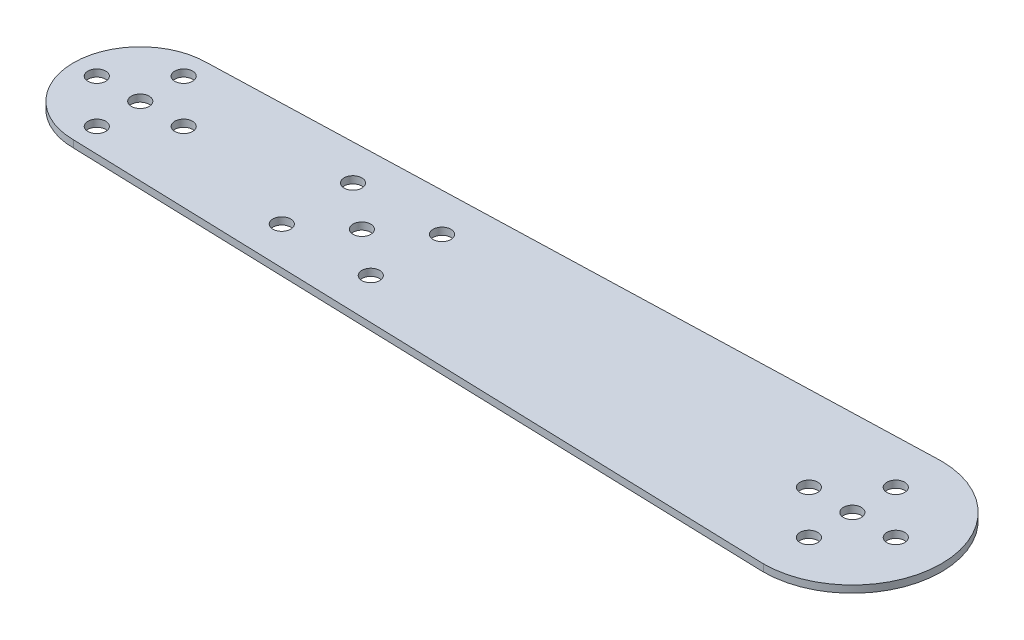
ISO-10303-21;
HEADER;
FILE_DESCRIPTION(('STEP AP214'),'2;1');
FILE_NAME('part.step','',(''),(''),'','','');
FILE_SCHEMA(('AUTOMOTIVE_DESIGN { 1 0 10303 214 1 1 1 1 }'));
ENDSEC;
DATA;
#1=APPLICATION_CONTEXT('core data for automotive mechanical design processes');
#2=APPLICATION_PROTOCOL_DEFINITION('international standard','automotive_design',2000,#1);
#3=PRODUCT_CONTEXT('',#1,'mechanical');
#4=PRODUCT('Part','Part','',(#3));
#5=PRODUCT_RELATED_PRODUCT_CATEGORY('part','',(#4));
#6=PRODUCT_DEFINITION_FORMATION('','',#4);
#7=PRODUCT_DEFINITION_CONTEXT('part definition',#1,'design');
#8=PRODUCT_DEFINITION('design','',#6,#7);
#9=PRODUCT_DEFINITION_SHAPE('','',#8);
#10=(LENGTH_UNIT() NAMED_UNIT(*) SI_UNIT(.MILLI.,.METRE.));
#11=(NAMED_UNIT(*) PLANE_ANGLE_UNIT() SI_UNIT($,.RADIAN.));
#12=(NAMED_UNIT(*) SI_UNIT($,.STERADIAN.) SOLID_ANGLE_UNIT());
#13=UNCERTAINTY_MEASURE_WITH_UNIT(LENGTH_MEASURE(1.E-05),#10,'distance_accuracy_value','');
#14=(GEOMETRIC_REPRESENTATION_CONTEXT(3) GLOBAL_UNCERTAINTY_ASSIGNED_CONTEXT((#13)) GLOBAL_UNIT_ASSIGNED_CONTEXT((#10,
#11,#12)) REPRESENTATION_CONTEXT('',''));
#15=CARTESIAN_POINT('',(0.,0.,0.));
#16=DIRECTION('',(0.,0.,1.));
#17=DIRECTION('',(1.,0.,0.));
#18=AXIS2_PLACEMENT_3D('',#15,#16,#17);
#19=CARTESIAN_POINT('',(100.,2.,0.));
#20=DIRECTION('',(0.,-1.,0.));
#21=DIRECTION('',(0.,0.,-1.));
#22=AXIS2_PLACEMENT_3D('',#19,#20,#21);
#23=CYLINDRICAL_SURFACE('',#22,25.);
#24=CARTESIAN_POINT('',(100.,0.,0.));
#25=DIRECTION('',(0.,1.,0.));
#26=DIRECTION('',(0.,0.,1.));
#27=AXIS2_PLACEMENT_3D('',#24,#25,#26);
#28=CIRCLE('',#27,25.);
#29=CARTESIAN_POINT('',(100.,0.,25.));
#30=VERTEX_POINT('',#29);
#31=CARTESIAN_POINT('',(100.,0.,-25.));
#32=VERTEX_POINT('',#31);
#33=EDGE_CURVE('E98',#30,#32,#28,.T.);
#34=ORIENTED_EDGE('',*,*,#33,.T.);
#35=DIRECTION('',(0.,-1.,0.));
#36=VECTOR('',#35,1.);
#37=CARTESIAN_POINT('',(100.,2.,-25.));
#38=LINE('',#37,#36);
#39=CARTESIAN_POINT('',(100.,2.,-25.));
#40=VERTEX_POINT('',#39);
#41=EDGE_CURVE('E11',#40,#32,#38,.T.);
#42=ORIENTED_EDGE('',*,*,#41,.F.);
#43=CARTESIAN_POINT('',(100.,2.,0.));
#44=DIRECTION('',(0.,1.,0.));
#45=DIRECTION('',(0.,0.,1.));
#46=AXIS2_PLACEMENT_3D('',#43,#44,#45);
#47=CIRCLE('',#46,25.);
#48=CARTESIAN_POINT('',(100.,2.,25.));
#49=VERTEX_POINT('',#48);
#50=EDGE_CURVE('E86',#49,#40,#47,.T.);
#51=ORIENTED_EDGE('',*,*,#50,.F.);
#52=DIRECTION('',(0.,-1.,0.));
#53=VECTOR('',#52,1.);
#54=CARTESIAN_POINT('',(100.,2.,25.));
#55=LINE('',#54,#53);
#56=EDGE_CURVE('E94',#49,#30,#55,.T.);
#57=ORIENTED_EDGE('',*,*,#56,.T.);
#58=EDGE_LOOP('',(#34,#42,#51,#57));
#59=FACE_BOUND('',#58,.T.);
#60=ADVANCED_FACE('F35',(#59),#23,.T.);
#61=CARTESIAN_POINT('',(100.,2.,-25.));
#62=DIRECTION('',(0.0312347523777212,0.,0.999512076087079));
#63=DIRECTION('',(0.999512076087079,0.,-0.0312347523777212));
#64=AXIS2_PLACEMENT_3D('',#61,#62,#63);
#65=PLANE('',#64);
#66=DIRECTION('',(-0.999512076087079,0.,0.0312347523777212));
#67=VECTOR('',#66,1.);
#68=CARTESIAN_POINT('',(100.,0.,-25.));
#69=LINE('',#68,#67);
#70=CARTESIAN_POINT('',(-100.,0.,-18.75));
#71=VERTEX_POINT('',#70);
#72=EDGE_CURVE('E90',#32,#71,#69,.T.);
#73=ORIENTED_EDGE('',*,*,#72,.T.);
#74=DIRECTION('',(0.,-1.,0.));
#75=VECTOR('',#74,1.);
#76=CARTESIAN_POINT('',(-100.,2.,-18.75));
#77=LINE('',#76,#75);
#78=CARTESIAN_POINT('',(-100.,2.,-18.75));
#79=VERTEX_POINT('',#78);
#80=EDGE_CURVE('E43',#79,#71,#77,.T.);
#81=ORIENTED_EDGE('',*,*,#80,.F.);
#82=DIRECTION('',(-0.999512076087079,0.,0.0312347523777212));
#83=VECTOR('',#82,1.);
#84=CARTESIAN_POINT('',(100.,2.,-25.));
#85=LINE('',#84,#83);
#86=EDGE_CURVE('E81',#40,#79,#85,.T.);
#87=ORIENTED_EDGE('',*,*,#86,.F.);
#88=ORIENTED_EDGE('',*,*,#41,.T.);
#89=EDGE_LOOP('',(#73,#81,#87,#88));
#90=FACE_BOUND('',#89,.T.);
#91=ADVANCED_FACE('F89',(#90),#65,.F.);
#92=CARTESIAN_POINT('',(-100.,2.,0.));
#93=DIRECTION('',(0.,-1.,0.));
#94=DIRECTION('',(0.,0.,-1.));
#95=AXIS2_PLACEMENT_3D('',#92,#93,#94);
#96=CYLINDRICAL_SURFACE('',#95,18.75);
#97=CARTESIAN_POINT('',(-100.,0.,0.));
#98=DIRECTION('',(0.,1.,0.));
#99=DIRECTION('',(0.,0.,1.));
#100=AXIS2_PLACEMENT_3D('',#97,#98,#99);
#101=CIRCLE('',#100,18.75);
#102=CARTESIAN_POINT('',(-100.,0.,18.75));
#103=VERTEX_POINT('',#102);
#104=EDGE_CURVE('E68',#71,#103,#101,.T.);
#105=ORIENTED_EDGE('',*,*,#104,.T.);
#106=DIRECTION('',(0.,-1.,0.));
#107=VECTOR('',#106,1.);
#108=CARTESIAN_POINT('',(-100.,2.,18.75));
#109=LINE('',#108,#107);
#110=CARTESIAN_POINT('',(-100.,2.,18.75));
#111=VERTEX_POINT('',#110);
#112=EDGE_CURVE('E91',#111,#103,#109,.T.);
#113=ORIENTED_EDGE('',*,*,#112,.F.);
#114=CARTESIAN_POINT('',(-100.,2.,0.));
#115=DIRECTION('',(0.,1.,0.));
#116=DIRECTION('',(0.,0.,1.));
#117=AXIS2_PLACEMENT_3D('',#114,#115,#116);
#118=CIRCLE('',#117,18.75);
#119=EDGE_CURVE('E84',#79,#111,#118,.T.);
#120=ORIENTED_EDGE('',*,*,#119,.F.);
#121=ORIENTED_EDGE('',*,*,#80,.T.);
#122=EDGE_LOOP('',(#105,#113,#120,#121));
#123=FACE_BOUND('',#122,.T.);
#124=ADVANCED_FACE('F92',(#123),#96,.T.);
#125=CARTESIAN_POINT('',(100.,2.,25.));
#126=DIRECTION('',(0.0312347523777212,0.,-0.999512076087079));
#127=DIRECTION('',(-0.999512076087079,0.,-0.0312347523777212));
#128=AXIS2_PLACEMENT_3D('',#125,#126,#127);
#129=PLANE('',#128);
#130=DIRECTION('',(0.999512076087079,0.,0.0312347523777212));
#131=VECTOR('',#130,1.);
#132=CARTESIAN_POINT('',(100.,0.,25.));
#133=LINE('',#132,#131);
#134=EDGE_CURVE('E74',#103,#30,#133,.T.);
#135=ORIENTED_EDGE('',*,*,#134,.T.);
#136=ORIENTED_EDGE('',*,*,#56,.F.);
#137=DIRECTION('',(0.999512076087079,0.,0.0312347523777212));
#138=VECTOR('',#137,1.);
#139=CARTESIAN_POINT('',(100.,2.,25.));
#140=LINE('',#139,#138);
#141=EDGE_CURVE('E51',#111,#49,#140,.T.);
#142=ORIENTED_EDGE('',*,*,#141,.F.);
#143=ORIENTED_EDGE('',*,*,#112,.T.);
#144=EDGE_LOOP('',(#135,#136,#142,#143));
#145=FACE_BOUND('',#144,.T.);
#146=ADVANCED_FACE('F106',(#145),#129,.F.);
#147=CARTESIAN_POINT('',(100.,2.,0.));
#148=DIRECTION('',(0.,1.,0.));
#149=DIRECTION('',(0.,0.,1.));
#150=AXIS2_PLACEMENT_3D('',#147,#148,#149);
#151=PLANE('',#150);
#152=CARTESIAN_POINT('',(-50.2499999985644,2.,10.));
#153=DIRECTION('',(0.,1.,0.));
#154=DIRECTION('',(0.,0.,1.));
#155=AXIS2_PLACEMENT_3D('',#152,#153,#154);
#156=CIRCLE('',#155,2.5);
#157=CARTESIAN_POINT('',(-50.2499999985644,2.,12.5));
#158=VERTEX_POINT('',#157);
#159=EDGE_CURVE('E182',#158,#158,#156,.T.);
#160=ORIENTED_EDGE('',*,*,#159,.F.);
#161=EDGE_LOOP('',(#160));
#162=FACE_BOUND('',#161,.T.);
#163=CARTESIAN_POINT('',(-50.2499999985644,2.,-10.));
#164=DIRECTION('',(0.,1.,0.));
#165=DIRECTION('',(0.,0.,1.));
#166=AXIS2_PLACEMENT_3D('',#163,#164,#165);
#167=CIRCLE('',#166,2.5);
#168=CARTESIAN_POINT('',(-50.2499999985644,2.,-7.5));
#169=VERTEX_POINT('',#168);
#170=EDGE_CURVE('E181',#169,#169,#167,.T.);
#171=ORIENTED_EDGE('',*,*,#170,.F.);
#172=EDGE_LOOP('',(#171));
#173=FACE_BOUND('',#172,.T.);
#174=CARTESIAN_POINT('',(-25.2499999985644,2.,10.));
#175=DIRECTION('',(0.,1.,0.));
#176=DIRECTION('',(0.,0.,1.));
#177=AXIS2_PLACEMENT_3D('',#174,#175,#176);
#178=CIRCLE('',#177,2.5);
#179=CARTESIAN_POINT('',(-25.2499999985644,2.,12.5));
#180=VERTEX_POINT('',#179);
#181=EDGE_CURVE('E188',#180,#180,#178,.T.);
#182=ORIENTED_EDGE('',*,*,#181,.F.);
#183=EDGE_LOOP('',(#182));
#184=FACE_BOUND('',#183,.T.);
#185=CARTESIAN_POINT('',(-25.2499999985644,2.,-10.));
#186=DIRECTION('',(0.,1.,0.));
#187=DIRECTION('',(0.,0.,1.));
#188=AXIS2_PLACEMENT_3D('',#185,#186,#187);
#189=CIRCLE('',#188,2.5);
#190=CARTESIAN_POINT('',(-25.2499999985644,2.,-7.5));
#191=VERTEX_POINT('',#190);
#192=EDGE_CURVE('E194',#191,#191,#189,.T.);
#193=ORIENTED_EDGE('',*,*,#192,.F.);
#194=EDGE_LOOP('',(#193));
#195=FACE_BOUND('',#194,.T.);
#196=CARTESIAN_POINT('',(-37.7499999985644,2.,0.));
#197=DIRECTION('',(0.,1.,0.));
#198=DIRECTION('',(0.,0.,1.));
#199=AXIS2_PLACEMENT_3D('',#196,#197,#198);
#200=CIRCLE('',#199,2.5);
#201=CARTESIAN_POINT('',(-37.7499999985644,2.,2.5));
#202=VERTEX_POINT('',#201);
#203=EDGE_CURVE('E174',#202,#202,#200,.T.);
#204=ORIENTED_EDGE('',*,*,#203,.F.);
#205=EDGE_LOOP('',(#204));
#206=FACE_BOUND('',#205,.T.);
#207=CARTESIAN_POINT('',(100.,2.,12.2));
#208=DIRECTION('',(0.,1.,0.));
#209=DIRECTION('',(0.,0.,1.));
#210=AXIS2_PLACEMENT_3D('',#207,#208,#209);
#211=CIRCLE('',#210,2.49999999999999);
#212=CARTESIAN_POINT('',(100.,2.,14.7));
#213=VERTEX_POINT('',#212);
#214=EDGE_CURVE('E147',#213,#213,#211,.T.);
#215=ORIENTED_EDGE('',*,*,#214,.F.);
#216=EDGE_LOOP('',(#215));
#217=FACE_BOUND('',#216,.T.);
#218=CARTESIAN_POINT('',(112.2,2.,0.));
#219=DIRECTION('',(0.,1.,0.));
#220=DIRECTION('',(0.,0.,1.));
#221=AXIS2_PLACEMENT_3D('',#218,#219,#220);
#222=CIRCLE('',#221,2.5);
#223=CARTESIAN_POINT('',(112.2,2.,2.5));
#224=VERTEX_POINT('',#223);
#225=EDGE_CURVE('E141',#224,#224,#222,.T.);
#226=ORIENTED_EDGE('',*,*,#225,.F.);
#227=EDGE_LOOP('',(#226));
#228=FACE_BOUND('',#227,.T.);
#229=CARTESIAN_POINT('',(87.8,2.,0.));
#230=DIRECTION('',(0.,1.,0.));
#231=DIRECTION('',(0.,0.,1.));
#232=AXIS2_PLACEMENT_3D('',#229,#230,#231);
#233=CIRCLE('',#232,2.49999999999999);
#234=CARTESIAN_POINT('',(87.8,2.,2.49999999999999));
#235=VERTEX_POINT('',#234);
#236=EDGE_CURVE('E133',#235,#235,#233,.T.);
#237=ORIENTED_EDGE('',*,*,#236,.F.);
#238=EDGE_LOOP('',(#237));
#239=FACE_BOUND('',#238,.T.);
#240=CARTESIAN_POINT('',(-100.,2.,-12.2));
#241=DIRECTION('',(0.,1.,0.));
#242=DIRECTION('',(0.,0.,1.));
#243=AXIS2_PLACEMENT_3D('',#240,#241,#242);
#244=CIRCLE('',#243,2.5);
#245=CARTESIAN_POINT('',(-100.,2.,-9.7));
#246=VERTEX_POINT('',#245);
#247=EDGE_CURVE('E134',#246,#246,#244,.T.);
#248=ORIENTED_EDGE('',*,*,#247,.F.);
#249=EDGE_LOOP('',(#248));
#250=FACE_BOUND('',#249,.T.);
#251=CARTESIAN_POINT('',(-87.8,2.,0.));
#252=DIRECTION('',(0.,1.,0.));
#253=DIRECTION('',(0.,0.,1.));
#254=AXIS2_PLACEMENT_3D('',#251,#252,#253);
#255=CIRCLE('',#254,2.50000000000001);
#256=CARTESIAN_POINT('',(-87.8,2.,2.50000000000001));
#257=VERTEX_POINT('',#256);
#258=EDGE_CURVE('E165',#257,#257,#255,.T.);
#259=ORIENTED_EDGE('',*,*,#258,.F.);
#260=EDGE_LOOP('',(#259));
#261=FACE_BOUND('',#260,.T.);
#262=CARTESIAN_POINT('',(-112.2,2.,0.));
#263=DIRECTION('',(0.,1.,0.));
#264=DIRECTION('',(0.,0.,1.));
#265=AXIS2_PLACEMENT_3D('',#262,#263,#264);
#266=CIRCLE('',#265,2.49999999999999);
#267=CARTESIAN_POINT('',(-112.2,2.,2.5));
#268=VERTEX_POINT('',#267);
#269=EDGE_CURVE('E157',#268,#268,#266,.T.);
#270=ORIENTED_EDGE('',*,*,#269,.F.);
#271=EDGE_LOOP('',(#270));
#272=FACE_BOUND('',#271,.T.);
#273=CARTESIAN_POINT('',(-100.,2.,12.2));
#274=DIRECTION('',(0.,1.,0.));
#275=DIRECTION('',(0.,0.,1.));
#276=AXIS2_PLACEMENT_3D('',#273,#274,#275);
#277=CIRCLE('',#276,2.5);
#278=CARTESIAN_POINT('',(-100.,2.,14.7));
#279=VERTEX_POINT('',#278);
#280=EDGE_CURVE('E158',#279,#279,#277,.T.);
#281=ORIENTED_EDGE('',*,*,#280,.F.);
#282=EDGE_LOOP('',(#281));
#283=FACE_BOUND('',#282,.T.);
#284=CARTESIAN_POINT('',(100.,2.,-12.2));
#285=DIRECTION('',(0.,1.,0.));
#286=DIRECTION('',(0.,0.,1.));
#287=AXIS2_PLACEMENT_3D('',#284,#285,#286);
#288=CIRCLE('',#287,2.5);
#289=CARTESIAN_POINT('',(100.,2.,-9.7));
#290=VERTEX_POINT('',#289);
#291=EDGE_CURVE('E126',#290,#290,#288,.T.);
#292=ORIENTED_EDGE('',*,*,#291,.F.);
#293=EDGE_LOOP('',(#292));
#294=FACE_BOUND('',#293,.T.);
#295=CARTESIAN_POINT('',(100.,2.,0.));
#296=DIRECTION('',(0.,1.,0.));
#297=DIRECTION('',(0.,0.,1.));
#298=AXIS2_PLACEMENT_3D('',#295,#296,#297);
#299=CIRCLE('',#298,2.5);
#300=CARTESIAN_POINT('',(100.,2.,2.49999999999997));
#301=VERTEX_POINT('',#300);
#302=EDGE_CURVE('E120',#301,#301,#299,.T.);
#303=ORIENTED_EDGE('',*,*,#302,.F.);
#304=EDGE_LOOP('',(#303));
#305=FACE_BOUND('',#304,.T.);
#306=CARTESIAN_POINT('',(-100.,2.,0.));
#307=DIRECTION('',(0.,1.,0.));
#308=DIRECTION('',(0.,0.,1.));
#309=AXIS2_PLACEMENT_3D('',#306,#307,#308);
#310=CIRCLE('',#309,2.5);
#311=CARTESIAN_POINT('',(-100.,2.,2.5));
#312=VERTEX_POINT('',#311);
#313=EDGE_CURVE('E114',#312,#312,#310,.T.);
#314=ORIENTED_EDGE('',*,*,#313,.F.);
#315=EDGE_LOOP('',(#314));
#316=FACE_BOUND('',#315,.T.);
#317=ORIENTED_EDGE('',*,*,#50,.T.);
#318=ORIENTED_EDGE('',*,*,#86,.T.);
#319=ORIENTED_EDGE('',*,*,#119,.T.);
#320=ORIENTED_EDGE('',*,*,#141,.T.);
#321=EDGE_LOOP('',(#317,#318,#319,#320));
#322=FACE_BOUND('',#321,.T.);
#323=ADVANCED_FACE('F82',(#162,#173,#184,#195,#206,#217,#228,#239,#250,#261,#272,#283,#294,#305,
#316,#322),#151,.T.);
#324=CARTESIAN_POINT('',(100.,0.,0.));
#325=DIRECTION('',(0.,1.,0.));
#326=DIRECTION('',(0.,0.,1.));
#327=AXIS2_PLACEMENT_3D('',#324,#325,#326);
#328=PLANE('',#327);
#329=CARTESIAN_POINT('',(-50.2499999985644,0.,10.));
#330=DIRECTION('',(0.,1.,0.));
#331=DIRECTION('',(0.,0.,1.));
#332=AXIS2_PLACEMENT_3D('',#329,#330,#331);
#333=CIRCLE('',#332,2.5);
#334=CARTESIAN_POINT('',(-50.2499999985644,0.,12.5));
#335=VERTEX_POINT('',#334);
#336=EDGE_CURVE('E178',#335,#335,#333,.F.);
#337=ORIENTED_EDGE('',*,*,#336,.F.);
#338=EDGE_LOOP('',(#337));
#339=FACE_BOUND('',#338,.T.);
#340=CARTESIAN_POINT('',(-50.2499999985644,0.,-10.));
#341=DIRECTION('',(0.,1.,0.));
#342=DIRECTION('',(0.,0.,1.));
#343=AXIS2_PLACEMENT_3D('',#340,#341,#342);
#344=CIRCLE('',#343,2.5);
#345=CARTESIAN_POINT('',(-50.2499999985644,0.,-7.5));
#346=VERTEX_POINT('',#345);
#347=EDGE_CURVE('E185',#346,#346,#344,.F.);
#348=ORIENTED_EDGE('',*,*,#347,.F.);
#349=EDGE_LOOP('',(#348));
#350=FACE_BOUND('',#349,.T.);
#351=CARTESIAN_POINT('',(-25.2499999985644,0.,10.));
#352=DIRECTION('',(0.,1.,0.));
#353=DIRECTION('',(0.,0.,1.));
#354=AXIS2_PLACEMENT_3D('',#351,#352,#353);
#355=CIRCLE('',#354,2.5);
#356=CARTESIAN_POINT('',(-25.2499999985644,0.,12.5));
#357=VERTEX_POINT('',#356);
#358=EDGE_CURVE('E191',#357,#357,#355,.F.);
#359=ORIENTED_EDGE('',*,*,#358,.F.);
#360=EDGE_LOOP('',(#359));
#361=FACE_BOUND('',#360,.T.);
#362=CARTESIAN_POINT('',(-25.2499999985644,0.,-10.));
#363=DIRECTION('',(0.,1.,0.));
#364=DIRECTION('',(0.,0.,1.));
#365=AXIS2_PLACEMENT_3D('',#362,#363,#364);
#366=CIRCLE('',#365,2.5);
#367=CARTESIAN_POINT('',(-25.2499999985644,0.,-7.5));
#368=VERTEX_POINT('',#367);
#369=EDGE_CURVE('E177',#368,#368,#366,.F.);
#370=ORIENTED_EDGE('',*,*,#369,.F.);
#371=EDGE_LOOP('',(#370));
#372=FACE_BOUND('',#371,.T.);
#373=CARTESIAN_POINT('',(-37.7499999985644,0.,0.));
#374=DIRECTION('',(0.,1.,0.));
#375=DIRECTION('',(0.,0.,1.));
#376=AXIS2_PLACEMENT_3D('',#373,#374,#375);
#377=CIRCLE('',#376,2.5);
#378=CARTESIAN_POINT('',(-37.7499999985644,0.,2.5));
#379=VERTEX_POINT('',#378);
#380=EDGE_CURVE('E161',#379,#379,#377,.F.);
#381=ORIENTED_EDGE('',*,*,#380,.F.);
#382=EDGE_LOOP('',(#381));
#383=FACE_BOUND('',#382,.T.);
#384=CARTESIAN_POINT('',(100.,0.,12.2));
#385=DIRECTION('',(0.,1.,0.));
#386=DIRECTION('',(0.,0.,1.));
#387=AXIS2_PLACEMENT_3D('',#384,#385,#386);
#388=CIRCLE('',#387,2.49999999999999);
#389=CARTESIAN_POINT('',(100.,0.,14.7));
#390=VERTEX_POINT('',#389);
#391=EDGE_CURVE('E129',#390,#390,#388,.F.);
#392=ORIENTED_EDGE('',*,*,#391,.F.);
#393=EDGE_LOOP('',(#392));
#394=FACE_BOUND('',#393,.T.);
#395=CARTESIAN_POINT('',(112.2,0.,0.));
#396=DIRECTION('',(0.,1.,0.));
#397=DIRECTION('',(0.,0.,1.));
#398=AXIS2_PLACEMENT_3D('',#395,#396,#397);
#399=CIRCLE('',#398,2.5);
#400=CARTESIAN_POINT('',(112.2,0.,2.5));
#401=VERTEX_POINT('',#400);
#402=EDGE_CURVE('E144',#401,#401,#399,.F.);
#403=ORIENTED_EDGE('',*,*,#402,.F.);
#404=EDGE_LOOP('',(#403));
#405=FACE_BOUND('',#404,.T.);
#406=CARTESIAN_POINT('',(87.8,0.,0.));
#407=DIRECTION('',(0.,1.,0.));
#408=DIRECTION('',(0.,0.,1.));
#409=AXIS2_PLACEMENT_3D('',#406,#407,#408);
#410=CIRCLE('',#409,2.49999999999999);
#411=CARTESIAN_POINT('',(87.8,0.,2.49999999999999));
#412=VERTEX_POINT('',#411);
#413=EDGE_CURVE('E138',#412,#412,#410,.F.);
#414=ORIENTED_EDGE('',*,*,#413,.F.);
#415=EDGE_LOOP('',(#414));
#416=FACE_BOUND('',#415,.T.);
#417=CARTESIAN_POINT('',(-100.,0.,-12.2));
#418=DIRECTION('',(0.,1.,0.));
#419=DIRECTION('',(0.,0.,1.));
#420=AXIS2_PLACEMENT_3D('',#417,#418,#419);
#421=CIRCLE('',#420,2.5);
#422=CARTESIAN_POINT('',(-100.,0.,-9.7));
#423=VERTEX_POINT('',#422);
#424=EDGE_CURVE('E130',#423,#423,#421,.F.);
#425=ORIENTED_EDGE('',*,*,#424,.F.);
#426=EDGE_LOOP('',(#425));
#427=FACE_BOUND('',#426,.T.);
#428=CARTESIAN_POINT('',(-87.8,0.,0.));
#429=DIRECTION('',(0.,1.,0.));
#430=DIRECTION('',(0.,0.,1.));
#431=AXIS2_PLACEMENT_3D('',#428,#429,#430);
#432=CIRCLE('',#431,2.50000000000001);
#433=CARTESIAN_POINT('',(-87.8,0.,2.50000000000001));
#434=VERTEX_POINT('',#433);
#435=EDGE_CURVE('E137',#434,#434,#432,.F.);
#436=ORIENTED_EDGE('',*,*,#435,.F.);
#437=EDGE_LOOP('',(#436));
#438=FACE_BOUND('',#437,.T.);
#439=CARTESIAN_POINT('',(-112.2,0.,0.));
#440=DIRECTION('',(0.,1.,0.));
#441=DIRECTION('',(0.,0.,1.));
#442=AXIS2_PLACEMENT_3D('',#439,#440,#441);
#443=CIRCLE('',#442,2.49999999999999);
#444=CARTESIAN_POINT('',(-112.2,0.,2.5));
#445=VERTEX_POINT('',#444);
#446=EDGE_CURVE('E162',#445,#445,#443,.F.);
#447=ORIENTED_EDGE('',*,*,#446,.F.);
#448=EDGE_LOOP('',(#447));
#449=FACE_BOUND('',#448,.T.);
#450=CARTESIAN_POINT('',(-100.,0.,12.2));
#451=DIRECTION('',(0.,1.,0.));
#452=DIRECTION('',(0.,0.,1.));
#453=AXIS2_PLACEMENT_3D('',#450,#451,#452);
#454=CIRCLE('',#453,2.5);
#455=CARTESIAN_POINT('',(-100.,0.,14.7));
#456=VERTEX_POINT('',#455);
#457=EDGE_CURVE('E154',#456,#456,#454,.F.);
#458=ORIENTED_EDGE('',*,*,#457,.F.);
#459=EDGE_LOOP('',(#458));
#460=FACE_BOUND('',#459,.T.);
#461=CARTESIAN_POINT('',(100.,0.,-12.2));
#462=DIRECTION('',(0.,1.,0.));
#463=DIRECTION('',(0.,0.,1.));
#464=AXIS2_PLACEMENT_3D('',#461,#462,#463);
#465=CIRCLE('',#464,2.5);
#466=CARTESIAN_POINT('',(100.,0.,-9.7));
#467=VERTEX_POINT('',#466);
#468=EDGE_CURVE('E123',#467,#467,#465,.F.);
#469=ORIENTED_EDGE('',*,*,#468,.F.);
#470=EDGE_LOOP('',(#469));
#471=FACE_BOUND('',#470,.T.);
#472=CARTESIAN_POINT('',(100.,0.,0.));
#473=DIRECTION('',(0.,1.,0.));
#474=DIRECTION('',(0.,0.,1.));
#475=AXIS2_PLACEMENT_3D('',#472,#473,#474);
#476=CIRCLE('',#475,2.5);
#477=CARTESIAN_POINT('',(100.,0.,2.49999999999997));
#478=VERTEX_POINT('',#477);
#479=EDGE_CURVE('E117',#478,#478,#476,.T.);
#480=ORIENTED_EDGE('',*,*,#479,.T.);
#481=EDGE_LOOP('',(#480));
#482=FACE_BOUND('',#481,.T.);
#483=CARTESIAN_POINT('',(-100.,0.,0.));
#484=DIRECTION('',(0.,1.,0.));
#485=DIRECTION('',(0.,0.,1.));
#486=AXIS2_PLACEMENT_3D('',#483,#484,#485);
#487=CIRCLE('',#486,2.5);
#488=CARTESIAN_POINT('',(-100.,0.,2.5));
#489=VERTEX_POINT('',#488);
#490=EDGE_CURVE('E101',#489,#489,#487,.T.);
#491=ORIENTED_EDGE('',*,*,#490,.T.);
#492=EDGE_LOOP('',(#491));
#493=FACE_BOUND('',#492,.T.);
#494=ORIENTED_EDGE('',*,*,#33,.F.);
#495=ORIENTED_EDGE('',*,*,#134,.F.);
#496=ORIENTED_EDGE('',*,*,#104,.F.);
#497=ORIENTED_EDGE('',*,*,#72,.F.);
#498=EDGE_LOOP('',(#494,#495,#496,#497));
#499=FACE_BOUND('',#498,.T.);
#500=ADVANCED_FACE('F109',(#339,#350,#361,#372,#383,#394,#405,#416,#427,#438,#449,#460,#471,
#482,#493,#499),#328,.F.);
#501=CARTESIAN_POINT('',(-100.,2.,0.));
#502=DIRECTION('',(0.,1.,0.));
#503=DIRECTION('',(0.,0.,1.));
#504=AXIS2_PLACEMENT_3D('',#501,#502,#503);
#505=CYLINDRICAL_SURFACE('',#504,2.5);
#506=ORIENTED_EDGE('',*,*,#490,.F.);
#507=EDGE_LOOP('',(#506));
#508=FACE_BOUND('',#507,.T.);
#509=ORIENTED_EDGE('',*,*,#313,.T.);
#510=EDGE_LOOP('',(#509));
#511=FACE_BOUND('',#510,.T.);
#512=ADVANCED_FACE('F231',(#508,#511),#505,.F.);
#513=CARTESIAN_POINT('',(100.,2.,0.));
#514=DIRECTION('',(0.,1.,0.));
#515=DIRECTION('',(0.,0.,1.));
#516=AXIS2_PLACEMENT_3D('',#513,#514,#515);
#517=CYLINDRICAL_SURFACE('',#516,2.5);
#518=ORIENTED_EDGE('',*,*,#479,.F.);
#519=EDGE_LOOP('',(#518));
#520=FACE_BOUND('',#519,.T.);
#521=ORIENTED_EDGE('',*,*,#302,.T.);
#522=EDGE_LOOP('',(#521));
#523=FACE_BOUND('',#522,.T.);
#524=ADVANCED_FACE('F233',(#520,#523),#517,.F.);
#525=CARTESIAN_POINT('',(100.,-0.00100000000000013,-12.2));
#526=DIRECTION('',(0.,1.,0.));
#527=DIRECTION('',(0.,0.,1.));
#528=AXIS2_PLACEMENT_3D('',#525,#526,#527);
#529=CYLINDRICAL_SURFACE('',#528,2.5);
#530=ORIENTED_EDGE('',*,*,#291,.T.);
#531=EDGE_LOOP('',(#530));
#532=FACE_BOUND('',#531,.T.);
#533=ORIENTED_EDGE('',*,*,#468,.T.);
#534=EDGE_LOOP('',(#533));
#535=FACE_BOUND('',#534,.T.);
#536=ADVANCED_FACE('F240',(#532,#535),#529,.F.);
#537=CARTESIAN_POINT('',(-100.,-0.00100000000000013,12.2));
#538=DIRECTION('',(0.,1.,0.));
#539=DIRECTION('',(0.,0.,1.));
#540=AXIS2_PLACEMENT_3D('',#537,#538,#539);
#541=CYLINDRICAL_SURFACE('',#540,2.5);
#542=ORIENTED_EDGE('',*,*,#280,.T.);
#543=EDGE_LOOP('',(#542));
#544=FACE_BOUND('',#543,.T.);
#545=ORIENTED_EDGE('',*,*,#457,.T.);
#546=EDGE_LOOP('',(#545));
#547=FACE_BOUND('',#546,.T.);
#548=ADVANCED_FACE('F335',(#544,#547),#541,.F.);
#549=CARTESIAN_POINT('',(-112.2,-0.00100000000000013,0.));
#550=DIRECTION('',(0.,1.,0.));
#551=DIRECTION('',(0.,0.,1.));
#552=AXIS2_PLACEMENT_3D('',#549,#550,#551);
#553=CYLINDRICAL_SURFACE('',#552,2.49999999999999);
#554=ORIENTED_EDGE('',*,*,#269,.T.);
#555=EDGE_LOOP('',(#554));
#556=FACE_BOUND('',#555,.T.);
#557=ORIENTED_EDGE('',*,*,#446,.T.);
#558=EDGE_LOOP('',(#557));
#559=FACE_BOUND('',#558,.T.);
#560=ADVANCED_FACE('F331',(#556,#559),#553,.F.);
#561=CARTESIAN_POINT('',(-87.8,-0.00100000000000013,0.));
#562=DIRECTION('',(0.,1.,0.));
#563=DIRECTION('',(0.,0.,1.));
#564=AXIS2_PLACEMENT_3D('',#561,#562,#563);
#565=CYLINDRICAL_SURFACE('',#564,2.50000000000001);
#566=ORIENTED_EDGE('',*,*,#258,.T.);
#567=EDGE_LOOP('',(#566));
#568=FACE_BOUND('',#567,.T.);
#569=ORIENTED_EDGE('',*,*,#435,.T.);
#570=EDGE_LOOP('',(#569));
#571=FACE_BOUND('',#570,.T.);
#572=ADVANCED_FACE('F327',(#568,#571),#565,.F.);
#573=CARTESIAN_POINT('',(-100.,-0.00100000000000013,-12.2));
#574=DIRECTION('',(0.,1.,0.));
#575=DIRECTION('',(0.,0.,1.));
#576=AXIS2_PLACEMENT_3D('',#573,#574,#575);
#577=CYLINDRICAL_SURFACE('',#576,2.5);
#578=ORIENTED_EDGE('',*,*,#247,.T.);
#579=EDGE_LOOP('',(#578));
#580=FACE_BOUND('',#579,.T.);
#581=ORIENTED_EDGE('',*,*,#424,.T.);
#582=EDGE_LOOP('',(#581));
#583=FACE_BOUND('',#582,.T.);
#584=ADVANCED_FACE('F330',(#580,#583),#577,.F.);
#585=CARTESIAN_POINT('',(87.8,-0.00100000000000013,0.));
#586=DIRECTION('',(0.,1.,0.));
#587=DIRECTION('',(0.,0.,1.));
#588=AXIS2_PLACEMENT_3D('',#585,#586,#587);
#589=CYLINDRICAL_SURFACE('',#588,2.49999999999999);
#590=ORIENTED_EDGE('',*,*,#236,.T.);
#591=EDGE_LOOP('',(#590));
#592=FACE_BOUND('',#591,.T.);
#593=ORIENTED_EDGE('',*,*,#413,.T.);
#594=EDGE_LOOP('',(#593));
#595=FACE_BOUND('',#594,.T.);
#596=ADVANCED_FACE('F345',(#592,#595),#589,.F.);
#597=CARTESIAN_POINT('',(112.2,-0.00100000000000013,0.));
#598=DIRECTION('',(0.,1.,0.));
#599=DIRECTION('',(0.,0.,1.));
#600=AXIS2_PLACEMENT_3D('',#597,#598,#599);
#601=CYLINDRICAL_SURFACE('',#600,2.5);
#602=ORIENTED_EDGE('',*,*,#225,.T.);
#603=EDGE_LOOP('',(#602));
#604=FACE_BOUND('',#603,.T.);
#605=ORIENTED_EDGE('',*,*,#402,.T.);
#606=EDGE_LOOP('',(#605));
#607=FACE_BOUND('',#606,.T.);
#608=ADVANCED_FACE('F341',(#604,#607),#601,.F.);
#609=CARTESIAN_POINT('',(100.,-0.00100000000000013,12.2));
#610=DIRECTION('',(0.,1.,0.));
#611=DIRECTION('',(0.,0.,1.));
#612=AXIS2_PLACEMENT_3D('',#609,#610,#611);
#613=CYLINDRICAL_SURFACE('',#612,2.49999999999999);
#614=ORIENTED_EDGE('',*,*,#214,.T.);
#615=EDGE_LOOP('',(#614));
#616=FACE_BOUND('',#615,.T.);
#617=ORIENTED_EDGE('',*,*,#391,.T.);
#618=EDGE_LOOP('',(#617));
#619=FACE_BOUND('',#618,.T.);
#620=ADVANCED_FACE('F280',(#616,#619),#613,.F.);
#621=CARTESIAN_POINT('',(-37.7499999985644,-0.00100000000000013,0.));
#622=DIRECTION('',(0.,1.,0.));
#623=DIRECTION('',(0.,0.,1.));
#624=AXIS2_PLACEMENT_3D('',#621,#622,#623);
#625=CYLINDRICAL_SURFACE('',#624,2.5);
#626=ORIENTED_EDGE('',*,*,#203,.T.);
#627=EDGE_LOOP('',(#626));
#628=FACE_BOUND('',#627,.T.);
#629=ORIENTED_EDGE('',*,*,#380,.T.);
#630=EDGE_LOOP('',(#629));
#631=FACE_BOUND('',#630,.T.);
#632=ADVANCED_FACE('F275',(#628,#631),#625,.F.);
#633=CARTESIAN_POINT('',(-25.2499999985644,-0.00100000000000013,-10.));
#634=DIRECTION('',(0.,1.,0.));
#635=DIRECTION('',(0.,0.,1.));
#636=AXIS2_PLACEMENT_3D('',#633,#634,#635);
#637=CYLINDRICAL_SURFACE('',#636,2.5);
#638=ORIENTED_EDGE('',*,*,#192,.T.);
#639=EDGE_LOOP('',(#638));
#640=FACE_BOUND('',#639,.T.);
#641=ORIENTED_EDGE('',*,*,#369,.T.);
#642=EDGE_LOOP('',(#641));
#643=FACE_BOUND('',#642,.T.);
#644=ADVANCED_FACE('F202',(#640,#643),#637,.F.);
#645=CARTESIAN_POINT('',(-25.2499999985644,-0.00100000000000013,10.));
#646=DIRECTION('',(0.,1.,0.));
#647=DIRECTION('',(0.,0.,1.));
#648=AXIS2_PLACEMENT_3D('',#645,#646,#647);
#649=CYLINDRICAL_SURFACE('',#648,2.5);
#650=ORIENTED_EDGE('',*,*,#181,.T.);
#651=EDGE_LOOP('',(#650));
#652=FACE_BOUND('',#651,.T.);
#653=ORIENTED_EDGE('',*,*,#358,.T.);
#654=EDGE_LOOP('',(#653));
#655=FACE_BOUND('',#654,.T.);
#656=ADVANCED_FACE('F292',(#652,#655),#649,.F.);
#657=CARTESIAN_POINT('',(-50.2499999985644,-0.00100000000000013,-10.));
#658=DIRECTION('',(0.,1.,0.));
#659=DIRECTION('',(0.,0.,1.));
#660=AXIS2_PLACEMENT_3D('',#657,#658,#659);
#661=CYLINDRICAL_SURFACE('',#660,2.5);
#662=ORIENTED_EDGE('',*,*,#170,.T.);
#663=EDGE_LOOP('',(#662));
#664=FACE_BOUND('',#663,.T.);
#665=ORIENTED_EDGE('',*,*,#347,.T.);
#666=EDGE_LOOP('',(#665));
#667=FACE_BOUND('',#666,.T.);
#668=ADVANCED_FACE('F301',(#664,#667),#661,.F.);
#669=CARTESIAN_POINT('',(-50.2499999985644,-0.00100000000000013,10.));
#670=DIRECTION('',(0.,1.,0.));
#671=DIRECTION('',(0.,0.,1.));
#672=AXIS2_PLACEMENT_3D('',#669,#670,#671);
#673=CYLINDRICAL_SURFACE('',#672,2.5);
#674=ORIENTED_EDGE('',*,*,#159,.T.);
#675=EDGE_LOOP('',(#674));
#676=FACE_BOUND('',#675,.T.);
#677=ORIENTED_EDGE('',*,*,#336,.T.);
#678=EDGE_LOOP('',(#677));
#679=FACE_BOUND('',#678,.T.);
#680=ADVANCED_FACE('F311',(#676,#679),#673,.F.);
#681=CLOSED_SHELL('',(#60,#91,#124,#146,#323,#500,#512,#524,#536,#548,#560,#572,#584,#596,#608,
#620,#632,#644,#656,#668,#680));
#682=MANIFOLD_SOLID_BREP('B2',#681);
#683=ADVANCED_BREP_SHAPE_REPRESENTATION('',(#18,#682),#14);
#684=SHAPE_DEFINITION_REPRESENTATION(#9,#683);
ENDSEC;
END-ISO-10303-21;
